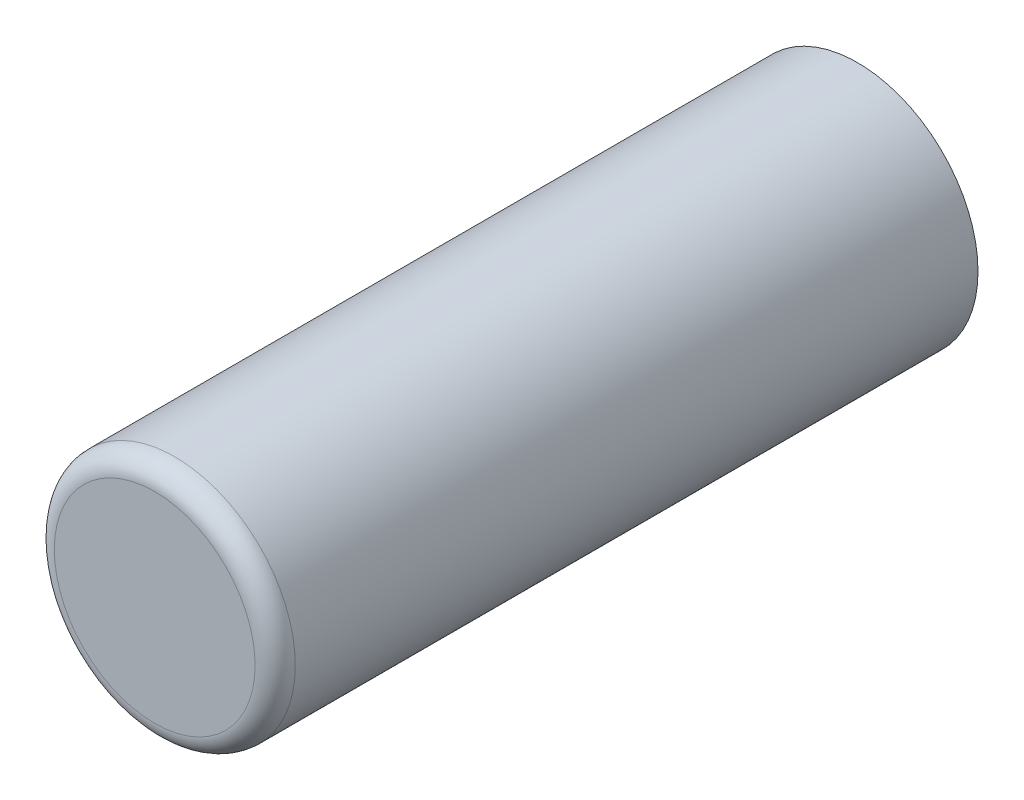
ISO-10303-21;
HEADER;
FILE_DESCRIPTION(('STEP AP214'),'2;1');
FILE_NAME('part.step','',(''),(''),'','','');
FILE_SCHEMA(('AUTOMOTIVE_DESIGN { 1 0 10303 214 1 1 1 1 }'));
ENDSEC;
DATA;
#1=APPLICATION_CONTEXT('core data for automotive mechanical design processes');
#2=APPLICATION_PROTOCOL_DEFINITION('international standard','automotive_design',2000,#1);
#3=PRODUCT_CONTEXT('',#1,'mechanical');
#4=PRODUCT('Part','Part','',(#3));
#5=PRODUCT_RELATED_PRODUCT_CATEGORY('part','',(#4));
#6=PRODUCT_DEFINITION_FORMATION('','',#4);
#7=PRODUCT_DEFINITION_CONTEXT('part definition',#1,'design');
#8=PRODUCT_DEFINITION('design','',#6,#7);
#9=PRODUCT_DEFINITION_SHAPE('','',#8);
#10=(LENGTH_UNIT() NAMED_UNIT(*) SI_UNIT(.MILLI.,.METRE.));
#11=(NAMED_UNIT(*) PLANE_ANGLE_UNIT() SI_UNIT($,.RADIAN.));
#12=(NAMED_UNIT(*) SI_UNIT($,.STERADIAN.) SOLID_ANGLE_UNIT());
#13=UNCERTAINTY_MEASURE_WITH_UNIT(LENGTH_MEASURE(1.E-05),#10,'distance_accuracy_value','');
#14=(GEOMETRIC_REPRESENTATION_CONTEXT(3) GLOBAL_UNCERTAINTY_ASSIGNED_CONTEXT((#13)) GLOBAL_UNIT_ASSIGNED_CONTEXT((#10,
#11,#12)) REPRESENTATION_CONTEXT('',''));
#15=CARTESIAN_POINT('',(0.,0.,0.));
#16=DIRECTION('',(0.,0.,1.));
#17=DIRECTION('',(1.,0.,0.));
#18=AXIS2_PLACEMENT_3D('',#15,#16,#17);
#19=CARTESIAN_POINT('',(0.,0.,14.));
#20=DIRECTION('',(0.,0.,-1.));
#21=DIRECTION('',(-1.,0.,0.));
#22=AXIS2_PLACEMENT_3D('',#19,#20,#21);
#23=CYLINDRICAL_SURFACE('',#22,4.8);
#24=CARTESIAN_POINT('',(0.,0.,13.2));
#25=DIRECTION('',(0.,0.,1.));
#26=DIRECTION('',(1.,0.,0.));
#27=AXIS2_PLACEMENT_3D('',#24,#25,#26);
#28=CIRCLE('',#27,4.8);
#29=CARTESIAN_POINT('',(4.8,0.,13.2));
#30=VERTEX_POINT('',#29);
#31=EDGE_CURVE('E10',#30,#30,#28,.F.);
#32=ORIENTED_EDGE('',*,*,#31,.T.);
#33=EDGE_LOOP('',(#32));
#34=FACE_BOUND('',#33,.T.);
#35=CARTESIAN_POINT('',(0.,0.,-14.));
#36=DIRECTION('',(0.,0.,1.));
#37=DIRECTION('',(1.,0.,0.));
#38=AXIS2_PLACEMENT_3D('',#35,#36,#37);
#39=CIRCLE('',#38,4.8);
#40=CARTESIAN_POINT('',(4.8,0.,-14.));
#41=VERTEX_POINT('',#40);
#42=EDGE_CURVE('E43',#41,#41,#39,.T.);
#43=ORIENTED_EDGE('',*,*,#42,.T.);
#44=EDGE_LOOP('',(#43));
#45=FACE_BOUND('',#44,.T.);
#46=ADVANCED_FACE('F32',(#34,#45),#23,.T.);
#47=CARTESIAN_POINT('',(0.,0.,14.));
#48=DIRECTION('',(0.,0.,1.));
#49=DIRECTION('',(1.,0.,0.));
#50=AXIS2_PLACEMENT_3D('',#47,#48,#49);
#51=PLANE('',#50);
#52=CARTESIAN_POINT('',(0.,0.,14.));
#53=DIRECTION('',(0.,0.,1.));
#54=DIRECTION('',(1.,0.,0.));
#55=AXIS2_PLACEMENT_3D('',#52,#53,#54);
#56=CIRCLE('',#55,4.);
#57=CARTESIAN_POINT('',(4.,0.,14.));
#58=VERTEX_POINT('',#57);
#59=EDGE_CURVE('E39',#58,#58,#56,.T.);
#60=ORIENTED_EDGE('',*,*,#59,.T.);
#61=EDGE_LOOP('',(#60));
#62=FACE_BOUND('',#61,.T.);
#63=ADVANCED_FACE('F53',(#62),#51,.T.);
#64=CARTESIAN_POINT('',(0.,0.,-14.));
#65=DIRECTION('',(0.,0.,1.));
#66=DIRECTION('',(1.,0.,0.));
#67=AXIS2_PLACEMENT_3D('',#64,#65,#66);
#68=PLANE('',#67);
#69=ORIENTED_EDGE('',*,*,#42,.F.);
#70=EDGE_LOOP('',(#69));
#71=FACE_BOUND('',#70,.T.);
#72=ADVANCED_FACE('F51',(#71),#68,.F.);
#73=CARTESIAN_POINT('',(0.,0.,13.2));
#74=DIRECTION('',(0.,0.,1.));
#75=DIRECTION('',(1.,0.,0.));
#76=AXIS2_PLACEMENT_3D('',#73,#74,#75);
#77=TOROIDAL_SURFACE('',#76,4.,0.8);
#78=ORIENTED_EDGE('',*,*,#31,.F.);
#79=EDGE_LOOP('',(#78));
#80=FACE_BOUND('',#79,.T.);
#81=ORIENTED_EDGE('',*,*,#59,.F.);
#82=EDGE_LOOP('',(#81));
#83=FACE_BOUND('',#82,.T.);
#84=ADVANCED_FACE('F34',(#80,#83),#77,.T.);
#85=CLOSED_SHELL('',(#46,#63,#72,#84));
#86=MANIFOLD_SOLID_BREP('B2',#85);
#87=ADVANCED_BREP_SHAPE_REPRESENTATION('',(#18,#86),#14);
#88=SHAPE_DEFINITION_REPRESENTATION(#9,#87);
ENDSEC;
END-ISO-10303-21;
